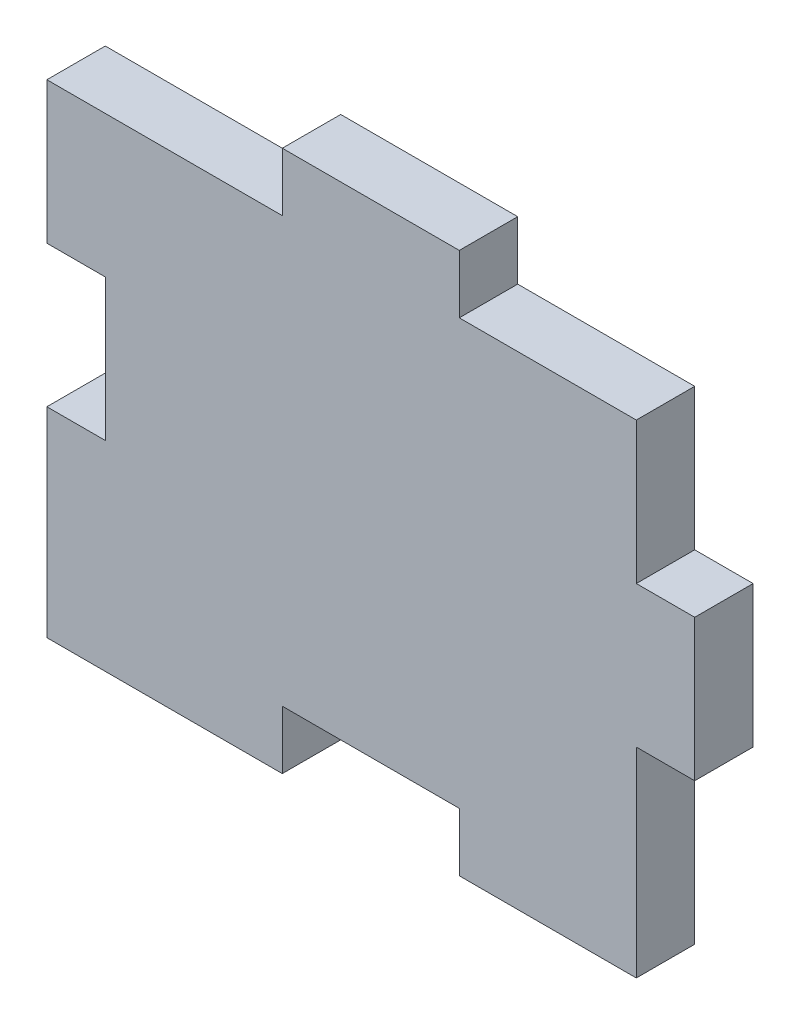
ISO-10303-21;
HEADER;
FILE_DESCRIPTION(('STEP AP214'),'2;1');
FILE_NAME('part.step','',(''),(''),'','','');
FILE_SCHEMA(('AUTOMOTIVE_DESIGN { 1 0 10303 214 1 1 1 1 }'));
ENDSEC;
DATA;
#1=APPLICATION_CONTEXT('core data for automotive mechanical design processes');
#2=APPLICATION_PROTOCOL_DEFINITION('international standard','automotive_design',2000,#1);
#3=PRODUCT_CONTEXT('',#1,'mechanical');
#4=PRODUCT('Part','Part','',(#3));
#5=PRODUCT_RELATED_PRODUCT_CATEGORY('part','',(#4));
#6=PRODUCT_DEFINITION_FORMATION('','',#4);
#7=PRODUCT_DEFINITION_CONTEXT('part definition',#1,'design');
#8=PRODUCT_DEFINITION('design','',#6,#7);
#9=PRODUCT_DEFINITION_SHAPE('','',#8);
#10=(LENGTH_UNIT() NAMED_UNIT(*) SI_UNIT(.MILLI.,.METRE.));
#11=(NAMED_UNIT(*) PLANE_ANGLE_UNIT() SI_UNIT($,.RADIAN.));
#12=(NAMED_UNIT(*) SI_UNIT($,.STERADIAN.) SOLID_ANGLE_UNIT());
#13=UNCERTAINTY_MEASURE_WITH_UNIT(LENGTH_MEASURE(1.E-05),#10,'distance_accuracy_value','');
#14=(GEOMETRIC_REPRESENTATION_CONTEXT(3) GLOBAL_UNCERTAINTY_ASSIGNED_CONTEXT((#13)) GLOBAL_UNIT_ASSIGNED_CONTEXT((#10,
#11,#12)) REPRESENTATION_CONTEXT('',''));
#15=CARTESIAN_POINT('',(0.,0.,0.));
#16=DIRECTION('',(0.,0.,1.));
#17=DIRECTION('',(1.,0.,0.));
#18=AXIS2_PLACEMENT_3D('',#15,#16,#17);
#19=CARTESIAN_POINT('',(33.3333333333333,40.,5.5));
#20=DIRECTION('',(0.,-1.,0.));
#21=DIRECTION('',(1.,0.,0.));
#22=AXIS2_PLACEMENT_3D('',#19,#20,#21);
#23=PLANE('',#22);
#24=DIRECTION('',(-1.,0.,0.));
#25=VECTOR('',#24,1.);
#26=CARTESIAN_POINT('',(33.3333333333333,40.,0.));
#27=LINE('',#26,#25);
#28=CARTESIAN_POINT('',(50.,40.,0.));
#29=VERTEX_POINT('',#28);
#30=CARTESIAN_POINT('',(33.3333333333333,40.,0.));
#31=VERTEX_POINT('',#30);
#32=EDGE_CURVE('E199',#29,#31,#27,.T.);
#33=ORIENTED_EDGE('',*,*,#32,.T.);
#34=DIRECTION('',(0.,0.,-1.));
#35=VECTOR('',#34,1.);
#36=CARTESIAN_POINT('',(33.3333333333333,40.,5.5));
#37=LINE('',#36,#35);
#38=CARTESIAN_POINT('',(33.3333333333333,40.,5.5));
#39=VERTEX_POINT('',#38);
#40=EDGE_CURVE('E11',#39,#31,#37,.T.);
#41=ORIENTED_EDGE('',*,*,#40,.F.);
#42=DIRECTION('',(-1.,0.,0.));
#43=VECTOR('',#42,1.);
#44=CARTESIAN_POINT('',(33.3333333333333,40.,5.5));
#45=LINE('',#44,#43);
#46=CARTESIAN_POINT('',(50.,40.,5.5));
#47=VERTEX_POINT('',#46);
#48=EDGE_CURVE('E240',#47,#39,#45,.T.);
#49=ORIENTED_EDGE('',*,*,#48,.F.);
#50=DIRECTION('',(0.,0.,-1.));
#51=VECTOR('',#50,1.);
#52=CARTESIAN_POINT('',(50.,40.,5.5));
#53=LINE('',#52,#51);
#54=EDGE_CURVE('E195',#47,#29,#53,.T.);
#55=ORIENTED_EDGE('',*,*,#54,.T.);
#56=EDGE_LOOP('',(#33,#41,#49,#55));
#57=FACE_BOUND('',#56,.T.);
#58=ADVANCED_FACE('F31',(#57),#23,.F.);
#59=CARTESIAN_POINT('',(33.3333333333333,40.,5.5));
#60=DIRECTION('',(-1.,0.,0.));
#61=DIRECTION('',(0.,-1.,0.));
#62=AXIS2_PLACEMENT_3D('',#59,#60,#61);
#63=PLANE('',#62);
#64=DIRECTION('',(0.,1.,0.));
#65=VECTOR('',#64,1.);
#66=CARTESIAN_POINT('',(33.3333333333333,40.,0.));
#67=LINE('',#66,#65);
#68=CARTESIAN_POINT('',(33.3333333333333,45.5,0.));
#69=VERTEX_POINT('',#68);
#70=EDGE_CURVE('E202',#31,#69,#67,.T.);
#71=ORIENTED_EDGE('',*,*,#70,.T.);
#72=DIRECTION('',(0.,0.,-1.));
#73=VECTOR('',#72,1.);
#74=CARTESIAN_POINT('',(33.3333333333333,45.5,5.5));
#75=LINE('',#74,#73);
#76=CARTESIAN_POINT('',(33.3333333333333,45.5,5.5));
#77=VERTEX_POINT('',#76);
#78=EDGE_CURVE('E39',#77,#69,#75,.T.);
#79=ORIENTED_EDGE('',*,*,#78,.F.);
#80=DIRECTION('',(0.,1.,0.));
#81=VECTOR('',#80,1.);
#82=CARTESIAN_POINT('',(33.3333333333333,40.,5.5));
#83=LINE('',#82,#81);
#84=EDGE_CURVE('E126',#39,#77,#83,.T.);
#85=ORIENTED_EDGE('',*,*,#84,.F.);
#86=ORIENTED_EDGE('',*,*,#40,.T.);
#87=EDGE_LOOP('',(#71,#79,#85,#86));
#88=FACE_BOUND('',#87,.T.);
#89=ADVANCED_FACE('F356',(#88),#63,.F.);
#90=CARTESIAN_POINT('',(16.6666666666667,45.5,5.5));
#91=DIRECTION('',(0.,-1.,0.));
#92=DIRECTION('',(0.,0.,-1.));
#93=AXIS2_PLACEMENT_3D('',#90,#91,#92);
#94=PLANE('',#93);
#95=DIRECTION('',(-1.,0.,0.));
#96=VECTOR('',#95,1.);
#97=CARTESIAN_POINT('',(16.6666666666667,45.5,0.));
#98=LINE('',#97,#96);
#99=CARTESIAN_POINT('',(16.6666666666667,45.5,0.));
#100=VERTEX_POINT('',#99);
#101=EDGE_CURVE('E204',#69,#100,#98,.T.);
#102=ORIENTED_EDGE('',*,*,#101,.T.);
#103=DIRECTION('',(0.,0.,-1.));
#104=VECTOR('',#103,1.);
#105=CARTESIAN_POINT('',(16.6666666666667,45.5,5.5));
#106=LINE('',#105,#104);
#107=CARTESIAN_POINT('',(16.6666666666667,45.5,5.5));
#108=VERTEX_POINT('',#107);
#109=EDGE_CURVE('E283',#108,#100,#106,.T.);
#110=ORIENTED_EDGE('',*,*,#109,.F.);
#111=DIRECTION('',(-1.,0.,0.));
#112=VECTOR('',#111,1.);
#113=CARTESIAN_POINT('',(16.6666666666667,45.5,5.5));
#114=LINE('',#113,#112);
#115=EDGE_CURVE('E291',#77,#108,#114,.T.);
#116=ORIENTED_EDGE('',*,*,#115,.F.);
#117=ORIENTED_EDGE('',*,*,#78,.T.);
#118=EDGE_LOOP('',(#102,#110,#116,#117));
#119=FACE_BOUND('',#118,.T.);
#120=ADVANCED_FACE('F289',(#119),#94,.F.);
#121=CARTESIAN_POINT('',(16.6666666666667,40.,5.5));
#122=DIRECTION('',(1.,0.,0.));
#123=DIRECTION('',(0.,0.,-1.));
#124=AXIS2_PLACEMENT_3D('',#121,#122,#123);
#125=PLANE('',#124);
#126=DIRECTION('',(0.,-1.,0.));
#127=VECTOR('',#126,1.);
#128=CARTESIAN_POINT('',(16.6666666666667,40.,0.));
#129=LINE('',#128,#127);
#130=CARTESIAN_POINT('',(16.6666666666667,40.,0.));
#131=VERTEX_POINT('',#130);
#132=EDGE_CURVE('E206',#100,#131,#129,.T.);
#133=ORIENTED_EDGE('',*,*,#132,.T.);
#134=DIRECTION('',(0.,0.,-1.));
#135=VECTOR('',#134,1.);
#136=CARTESIAN_POINT('',(16.6666666666667,40.,5.5));
#137=LINE('',#136,#135);
#138=CARTESIAN_POINT('',(16.6666666666667,40.,5.5));
#139=VERTEX_POINT('',#138);
#140=EDGE_CURVE('E280',#139,#131,#137,.T.);
#141=ORIENTED_EDGE('',*,*,#140,.F.);
#142=DIRECTION('',(0.,-1.,0.));
#143=VECTOR('',#142,1.);
#144=CARTESIAN_POINT('',(16.6666666666667,40.,5.5));
#145=LINE('',#144,#143);
#146=EDGE_CURVE('E308',#108,#139,#145,.T.);
#147=ORIENTED_EDGE('',*,*,#146,.F.);
#148=ORIENTED_EDGE('',*,*,#109,.T.);
#149=EDGE_LOOP('',(#133,#141,#147,#148));
#150=FACE_BOUND('',#149,.T.);
#151=ADVANCED_FACE('F299',(#150),#125,.F.);
#152=CARTESIAN_POINT('',(0.,40.,5.5));
#153=DIRECTION('',(0.,-1.,0.));
#154=DIRECTION('',(0.,0.,-1.));
#155=AXIS2_PLACEMENT_3D('',#152,#153,#154);
#156=PLANE('',#155);
#157=DIRECTION('',(-1.,0.,0.));
#158=VECTOR('',#157,1.);
#159=CARTESIAN_POINT('',(0.,40.,0.));
#160=LINE('',#159,#158);
#161=CARTESIAN_POINT('',(-5.5,40.,0.));
#162=VERTEX_POINT('',#161);
#163=EDGE_CURVE('E209',#131,#162,#160,.T.);
#164=ORIENTED_EDGE('',*,*,#163,.T.);
#165=DIRECTION('',(0.,0.,-1.));
#166=VECTOR('',#165,1.);
#167=CARTESIAN_POINT('',(-5.5,40.,5.5));
#168=LINE('',#167,#166);
#169=CARTESIAN_POINT('',(-5.5,40.,5.5));
#170=VERTEX_POINT('',#169);
#171=EDGE_CURVE('E277',#170,#162,#168,.T.);
#172=ORIENTED_EDGE('',*,*,#171,.F.);
#173=DIRECTION('',(-1.,0.,0.));
#174=VECTOR('',#173,1.);
#175=CARTESIAN_POINT('',(0.,40.,5.5));
#176=LINE('',#175,#174);
#177=EDGE_CURVE('E305',#139,#170,#176,.T.);
#178=ORIENTED_EDGE('',*,*,#177,.F.);
#179=ORIENTED_EDGE('',*,*,#140,.T.);
#180=EDGE_LOOP('',(#164,#172,#178,#179));
#181=FACE_BOUND('',#180,.T.);
#182=ADVANCED_FACE('F303',(#181),#156,.F.);
#183=CARTESIAN_POINT('',(-5.5,40.,5.5));
#184=DIRECTION('',(1.,0.,0.));
#185=DIRECTION('',(0.,1.,0.));
#186=AXIS2_PLACEMENT_3D('',#183,#184,#185);
#187=PLANE('',#186);
#188=DIRECTION('',(0.,-1.,0.));
#189=VECTOR('',#188,1.);
#190=CARTESIAN_POINT('',(-5.5,40.,0.));
#191=LINE('',#190,#189);
#192=CARTESIAN_POINT('',(-5.5,26.6666666666667,0.));
#193=VERTEX_POINT('',#192);
#194=EDGE_CURVE('E211',#162,#193,#191,.T.);
#195=ORIENTED_EDGE('',*,*,#194,.T.);
#196=DIRECTION('',(0.,0.,-1.));
#197=VECTOR('',#196,1.);
#198=CARTESIAN_POINT('',(-5.5,26.6666666666667,5.5));
#199=LINE('',#198,#197);
#200=CARTESIAN_POINT('',(-5.5,26.6666666666667,5.5));
#201=VERTEX_POINT('',#200);
#202=EDGE_CURVE('E274',#201,#193,#199,.T.);
#203=ORIENTED_EDGE('',*,*,#202,.F.);
#204=DIRECTION('',(0.,-1.,0.));
#205=VECTOR('',#204,1.);
#206=CARTESIAN_POINT('',(-5.5,40.,5.5));
#207=LINE('',#206,#205);
#208=EDGE_CURVE('E307',#170,#201,#207,.T.);
#209=ORIENTED_EDGE('',*,*,#208,.F.);
#210=ORIENTED_EDGE('',*,*,#171,.T.);
#211=EDGE_LOOP('',(#195,#203,#209,#210));
#212=FACE_BOUND('',#211,.T.);
#213=ADVANCED_FACE('F369',(#212),#187,.F.);
#214=CARTESIAN_POINT('',(0.,26.6666666666667,5.5));
#215=DIRECTION('',(0.,1.,0.));
#216=DIRECTION('',(0.,0.,1.));
#217=AXIS2_PLACEMENT_3D('',#214,#215,#216);
#218=PLANE('',#217);
#219=DIRECTION('',(1.,0.,0.));
#220=VECTOR('',#219,1.);
#221=CARTESIAN_POINT('',(0.,26.6666666666667,0.));
#222=LINE('',#221,#220);
#223=CARTESIAN_POINT('',(0.,26.6666666666667,0.));
#224=VERTEX_POINT('',#223);
#225=EDGE_CURVE('E213',#193,#224,#222,.T.);
#226=ORIENTED_EDGE('',*,*,#225,.T.);
#227=DIRECTION('',(0.,0.,-1.));
#228=VECTOR('',#227,1.);
#229=CARTESIAN_POINT('',(0.,26.6666666666667,5.5));
#230=LINE('',#229,#228);
#231=CARTESIAN_POINT('',(0.,26.6666666666667,5.5));
#232=VERTEX_POINT('',#231);
#233=EDGE_CURVE('E271',#232,#224,#230,.T.);
#234=ORIENTED_EDGE('',*,*,#233,.F.);
#235=DIRECTION('',(1.,0.,0.));
#236=VECTOR('',#235,1.);
#237=CARTESIAN_POINT('',(0.,26.6666666666667,5.5));
#238=LINE('',#237,#236);
#239=EDGE_CURVE('E310',#201,#232,#238,.T.);
#240=ORIENTED_EDGE('',*,*,#239,.F.);
#241=ORIENTED_EDGE('',*,*,#202,.T.);
#242=EDGE_LOOP('',(#226,#234,#240,#241));
#243=FACE_BOUND('',#242,.T.);
#244=ADVANCED_FACE('F372',(#243),#218,.F.);
#245=CARTESIAN_POINT('',(0.,26.6666666666667,5.5));
#246=DIRECTION('',(1.,0.,0.));
#247=DIRECTION('',(0.,1.,0.));
#248=AXIS2_PLACEMENT_3D('',#245,#246,#247);
#249=PLANE('',#248);
#250=DIRECTION('',(0.,-1.,0.));
#251=VECTOR('',#250,1.);
#252=CARTESIAN_POINT('',(0.,26.6666666666667,0.));
#253=LINE('',#252,#251);
#254=CARTESIAN_POINT('',(0.,13.3333333333333,0.));
#255=VERTEX_POINT('',#254);
#256=EDGE_CURVE('E215',#224,#255,#253,.T.);
#257=ORIENTED_EDGE('',*,*,#256,.T.);
#258=DIRECTION('',(0.,0.,-1.));
#259=VECTOR('',#258,1.);
#260=CARTESIAN_POINT('',(0.,13.3333333333333,5.5));
#261=LINE('',#260,#259);
#262=CARTESIAN_POINT('',(0.,13.3333333333333,5.5));
#263=VERTEX_POINT('',#262);
#264=EDGE_CURVE('E268',#263,#255,#261,.T.);
#265=ORIENTED_EDGE('',*,*,#264,.F.);
#266=DIRECTION('',(0.,-1.,0.));
#267=VECTOR('',#266,1.);
#268=CARTESIAN_POINT('',(0.,26.6666666666667,5.5));
#269=LINE('',#268,#267);
#270=EDGE_CURVE('E316',#232,#263,#269,.T.);
#271=ORIENTED_EDGE('',*,*,#270,.F.);
#272=ORIENTED_EDGE('',*,*,#233,.T.);
#273=EDGE_LOOP('',(#257,#265,#271,#272));
#274=FACE_BOUND('',#273,.T.);
#275=ADVANCED_FACE('F376',(#274),#249,.F.);
#276=CARTESIAN_POINT('',(0.,13.3333333333333,5.5));
#277=DIRECTION('',(0.,-1.,0.));
#278=DIRECTION('',(0.,0.,-1.));
#279=AXIS2_PLACEMENT_3D('',#276,#277,#278);
#280=PLANE('',#279);
#281=DIRECTION('',(-1.,0.,0.));
#282=VECTOR('',#281,1.);
#283=CARTESIAN_POINT('',(0.,13.3333333333333,0.));
#284=LINE('',#283,#282);
#285=CARTESIAN_POINT('',(-5.5,13.3333333333333,0.));
#286=VERTEX_POINT('',#285);
#287=EDGE_CURVE('E217',#255,#286,#284,.T.);
#288=ORIENTED_EDGE('',*,*,#287,.T.);
#289=DIRECTION('',(0.,0.,-1.));
#290=VECTOR('',#289,1.);
#291=CARTESIAN_POINT('',(-5.5,13.3333333333333,5.5));
#292=LINE('',#291,#290);
#293=CARTESIAN_POINT('',(-5.5,13.3333333333333,5.5));
#294=VERTEX_POINT('',#293);
#295=EDGE_CURVE('E265',#294,#286,#292,.T.);
#296=ORIENTED_EDGE('',*,*,#295,.F.);
#297=DIRECTION('',(-1.,0.,0.));
#298=VECTOR('',#297,1.);
#299=CARTESIAN_POINT('',(0.,13.3333333333333,5.5));
#300=LINE('',#299,#298);
#301=EDGE_CURVE('E318',#263,#294,#300,.T.);
#302=ORIENTED_EDGE('',*,*,#301,.F.);
#303=ORIENTED_EDGE('',*,*,#264,.T.);
#304=EDGE_LOOP('',(#288,#296,#302,#303));
#305=FACE_BOUND('',#304,.T.);
#306=ADVANCED_FACE('F380',(#305),#280,.F.);
#307=CARTESIAN_POINT('',(-5.5,13.3333333333333,5.5));
#308=DIRECTION('',(1.,0.,0.));
#309=DIRECTION('',(0.,1.,0.));
#310=AXIS2_PLACEMENT_3D('',#307,#308,#309);
#311=PLANE('',#310);
#312=DIRECTION('',(0.,-1.,0.));
#313=VECTOR('',#312,1.);
#314=CARTESIAN_POINT('',(-5.5,13.3333333333333,0.));
#315=LINE('',#314,#313);
#316=CARTESIAN_POINT('',(-5.5,-5.50000000000001,0.));
#317=VERTEX_POINT('',#316);
#318=EDGE_CURVE('E219',#286,#317,#315,.T.);
#319=ORIENTED_EDGE('',*,*,#318,.T.);
#320=DIRECTION('',(0.,0.,-1.));
#321=VECTOR('',#320,1.);
#322=CARTESIAN_POINT('',(-5.5,-5.50000000000001,5.5));
#323=LINE('',#322,#321);
#324=CARTESIAN_POINT('',(-5.5,-5.50000000000001,5.5));
#325=VERTEX_POINT('',#324);
#326=EDGE_CURVE('E262',#325,#317,#323,.T.);
#327=ORIENTED_EDGE('',*,*,#326,.F.);
#328=DIRECTION('',(0.,-1.,0.));
#329=VECTOR('',#328,1.);
#330=CARTESIAN_POINT('',(-5.5,13.3333333333333,5.5));
#331=LINE('',#330,#329);
#332=EDGE_CURVE('E320',#294,#325,#331,.T.);
#333=ORIENTED_EDGE('',*,*,#332,.F.);
#334=ORIENTED_EDGE('',*,*,#295,.T.);
#335=EDGE_LOOP('',(#319,#327,#333,#334));
#336=FACE_BOUND('',#335,.T.);
#337=ADVANCED_FACE('F384',(#336),#311,.F.);
#338=CARTESIAN_POINT('',(0.,-5.50000000000001,5.5));
#339=DIRECTION('',(0.,1.,0.));
#340=DIRECTION('',(0.,0.,1.));
#341=AXIS2_PLACEMENT_3D('',#338,#339,#340);
#342=PLANE('',#341);
#343=DIRECTION('',(1.,0.,0.));
#344=VECTOR('',#343,1.);
#345=CARTESIAN_POINT('',(0.,-5.50000000000001,0.));
#346=LINE('',#345,#344);
#347=CARTESIAN_POINT('',(16.6666666666667,-5.50000000000001,0.));
#348=VERTEX_POINT('',#347);
#349=EDGE_CURVE('E222',#317,#348,#346,.T.);
#350=ORIENTED_EDGE('',*,*,#349,.T.);
#351=DIRECTION('',(0.,0.,-1.));
#352=VECTOR('',#351,1.);
#353=CARTESIAN_POINT('',(16.6666666666667,-5.50000000000001,5.5));
#354=LINE('',#353,#352);
#355=CARTESIAN_POINT('',(16.6666666666667,-5.50000000000001,5.5));
#356=VERTEX_POINT('',#355);
#357=EDGE_CURVE('E259',#356,#348,#354,.T.);
#358=ORIENTED_EDGE('',*,*,#357,.F.);
#359=DIRECTION('',(1.,0.,0.));
#360=VECTOR('',#359,1.);
#361=CARTESIAN_POINT('',(0.,-5.50000000000001,5.5));
#362=LINE('',#361,#360);
#363=EDGE_CURVE('E322',#325,#356,#362,.T.);
#364=ORIENTED_EDGE('',*,*,#363,.F.);
#365=ORIENTED_EDGE('',*,*,#326,.T.);
#366=EDGE_LOOP('',(#350,#358,#364,#365));
#367=FACE_BOUND('',#366,.T.);
#368=ADVANCED_FACE('F388',(#367),#342,.F.);
#369=CARTESIAN_POINT('',(16.6666666666667,0.,5.5));
#370=DIRECTION('',(-1.,0.,0.));
#371=DIRECTION('',(0.,-1.,0.));
#372=AXIS2_PLACEMENT_3D('',#369,#370,#371);
#373=PLANE('',#372);
#374=DIRECTION('',(0.,1.,0.));
#375=VECTOR('',#374,1.);
#376=CARTESIAN_POINT('',(16.6666666666667,0.,0.));
#377=LINE('',#376,#375);
#378=CARTESIAN_POINT('',(16.6666666666667,0.,0.));
#379=VERTEX_POINT('',#378);
#380=EDGE_CURVE('E224',#348,#379,#377,.T.);
#381=ORIENTED_EDGE('',*,*,#380,.T.);
#382=DIRECTION('',(0.,0.,-1.));
#383=VECTOR('',#382,1.);
#384=CARTESIAN_POINT('',(16.6666666666667,0.,5.5));
#385=LINE('',#384,#383);
#386=CARTESIAN_POINT('',(16.6666666666667,0.,5.5));
#387=VERTEX_POINT('',#386);
#388=EDGE_CURVE('E256',#387,#379,#385,.T.);
#389=ORIENTED_EDGE('',*,*,#388,.F.);
#390=DIRECTION('',(0.,1.,0.));
#391=VECTOR('',#390,1.);
#392=CARTESIAN_POINT('',(16.6666666666667,0.,5.5));
#393=LINE('',#392,#391);
#394=EDGE_CURVE('E324',#356,#387,#393,.T.);
#395=ORIENTED_EDGE('',*,*,#394,.F.);
#396=ORIENTED_EDGE('',*,*,#357,.T.);
#397=EDGE_LOOP('',(#381,#389,#395,#396));
#398=FACE_BOUND('',#397,.T.);
#399=ADVANCED_FACE('F392',(#398),#373,.F.);
#400=CARTESIAN_POINT('',(16.6666666666667,0.,5.5));
#401=DIRECTION('',(0.,1.,0.));
#402=DIRECTION('',(0.,0.,1.));
#403=AXIS2_PLACEMENT_3D('',#400,#401,#402);
#404=PLANE('',#403);
#405=DIRECTION('',(1.,0.,0.));
#406=VECTOR('',#405,1.);
#407=CARTESIAN_POINT('',(16.6666666666667,0.,0.));
#408=LINE('',#407,#406);
#409=CARTESIAN_POINT('',(33.3333333333333,0.,0.));
#410=VERTEX_POINT('',#409);
#411=EDGE_CURVE('E226',#379,#410,#408,.T.);
#412=ORIENTED_EDGE('',*,*,#411,.T.);
#413=DIRECTION('',(0.,0.,-1.));
#414=VECTOR('',#413,1.);
#415=CARTESIAN_POINT('',(33.3333333333333,0.,5.5));
#416=LINE('',#415,#414);
#417=CARTESIAN_POINT('',(33.3333333333333,0.,5.5));
#418=VERTEX_POINT('',#417);
#419=EDGE_CURVE('E253',#418,#410,#416,.T.);
#420=ORIENTED_EDGE('',*,*,#419,.F.);
#421=DIRECTION('',(1.,0.,0.));
#422=VECTOR('',#421,1.);
#423=CARTESIAN_POINT('',(16.6666666666667,0.,5.5));
#424=LINE('',#423,#422);
#425=EDGE_CURVE('E326',#387,#418,#424,.T.);
#426=ORIENTED_EDGE('',*,*,#425,.F.);
#427=ORIENTED_EDGE('',*,*,#388,.T.);
#428=EDGE_LOOP('',(#412,#420,#426,#427));
#429=FACE_BOUND('',#428,.T.);
#430=ADVANCED_FACE('F396',(#429),#404,.F.);
#431=CARTESIAN_POINT('',(33.3333333333333,0.,5.5));
#432=DIRECTION('',(1.,0.,0.));
#433=DIRECTION('',(0.,0.,-1.));
#434=AXIS2_PLACEMENT_3D('',#431,#432,#433);
#435=PLANE('',#434);
#436=DIRECTION('',(0.,-1.,0.));
#437=VECTOR('',#436,1.);
#438=CARTESIAN_POINT('',(33.3333333333333,0.,0.));
#439=LINE('',#438,#437);
#440=CARTESIAN_POINT('',(33.3333333333333,-5.5,0.));
#441=VERTEX_POINT('',#440);
#442=EDGE_CURVE('E228',#410,#441,#439,.T.);
#443=ORIENTED_EDGE('',*,*,#442,.T.);
#444=DIRECTION('',(0.,0.,-1.));
#445=VECTOR('',#444,1.);
#446=CARTESIAN_POINT('',(33.3333333333333,-5.5,5.5));
#447=LINE('',#446,#445);
#448=CARTESIAN_POINT('',(33.3333333333333,-5.5,5.5));
#449=VERTEX_POINT('',#448);
#450=EDGE_CURVE('E250',#449,#441,#447,.T.);
#451=ORIENTED_EDGE('',*,*,#450,.F.);
#452=DIRECTION('',(0.,-1.,0.));
#453=VECTOR('',#452,1.);
#454=CARTESIAN_POINT('',(33.3333333333333,0.,5.5));
#455=LINE('',#454,#453);
#456=EDGE_CURVE('E328',#418,#449,#455,.T.);
#457=ORIENTED_EDGE('',*,*,#456,.F.);
#458=ORIENTED_EDGE('',*,*,#419,.T.);
#459=EDGE_LOOP('',(#443,#451,#457,#458));
#460=FACE_BOUND('',#459,.T.);
#461=ADVANCED_FACE('F400',(#460),#435,.F.);
#462=CARTESIAN_POINT('',(50.,-5.5,5.5));
#463=DIRECTION('',(0.,1.,0.));
#464=DIRECTION('',(-1.,0.,0.));
#465=AXIS2_PLACEMENT_3D('',#462,#463,#464);
#466=PLANE('',#465);
#467=DIRECTION('',(1.,0.,0.));
#468=VECTOR('',#467,1.);
#469=CARTESIAN_POINT('',(50.,-5.5,0.));
#470=LINE('',#469,#468);
#471=CARTESIAN_POINT('',(50.,-5.5,0.));
#472=VERTEX_POINT('',#471);
#473=EDGE_CURVE('E230',#441,#472,#470,.T.);
#474=ORIENTED_EDGE('',*,*,#473,.T.);
#475=DIRECTION('',(0.,0.,-1.));
#476=VECTOR('',#475,1.);
#477=CARTESIAN_POINT('',(50.,-5.5,5.5));
#478=LINE('',#477,#476);
#479=CARTESIAN_POINT('',(50.,-5.5,5.5));
#480=VERTEX_POINT('',#479);
#481=EDGE_CURVE('E247',#480,#472,#478,.T.);
#482=ORIENTED_EDGE('',*,*,#481,.F.);
#483=DIRECTION('',(1.,0.,0.));
#484=VECTOR('',#483,1.);
#485=CARTESIAN_POINT('',(50.,-5.5,5.5));
#486=LINE('',#485,#484);
#487=EDGE_CURVE('E330',#449,#480,#486,.T.);
#488=ORIENTED_EDGE('',*,*,#487,.F.);
#489=ORIENTED_EDGE('',*,*,#450,.T.);
#490=EDGE_LOOP('',(#474,#482,#488,#489));
#491=FACE_BOUND('',#490,.T.);
#492=ADVANCED_FACE('F404',(#491),#466,.F.);
#493=CARTESIAN_POINT('',(50.,0.,5.5));
#494=DIRECTION('',(-1.,0.,0.));
#495=DIRECTION('',(0.,-1.,0.));
#496=AXIS2_PLACEMENT_3D('',#493,#494,#495);
#497=PLANE('',#496);
#498=DIRECTION('',(0.,1.,0.));
#499=VECTOR('',#498,1.);
#500=CARTESIAN_POINT('',(50.,0.,0.));
#501=LINE('',#500,#499);
#502=CARTESIAN_POINT('',(50.,13.3333333333333,0.));
#503=VERTEX_POINT('',#502);
#504=EDGE_CURVE('E233',#472,#503,#501,.T.);
#505=ORIENTED_EDGE('',*,*,#504,.T.);
#506=DIRECTION('',(0.,0.,-1.));
#507=VECTOR('',#506,1.);
#508=CARTESIAN_POINT('',(50.,13.3333333333333,5.5));
#509=LINE('',#508,#507);
#510=CARTESIAN_POINT('',(50.,13.3333333333333,5.5));
#511=VERTEX_POINT('',#510);
#512=EDGE_CURVE('E244',#511,#503,#509,.T.);
#513=ORIENTED_EDGE('',*,*,#512,.F.);
#514=DIRECTION('',(0.,1.,0.));
#515=VECTOR('',#514,1.);
#516=CARTESIAN_POINT('',(50.,0.,5.5));
#517=LINE('',#516,#515);
#518=EDGE_CURVE('E332',#480,#511,#517,.T.);
#519=ORIENTED_EDGE('',*,*,#518,.F.);
#520=ORIENTED_EDGE('',*,*,#481,.T.);
#521=EDGE_LOOP('',(#505,#513,#519,#520));
#522=FACE_BOUND('',#521,.T.);
#523=ADVANCED_FACE('F338',(#522),#497,.F.);
#524=CARTESIAN_POINT('',(50.,13.3333333333333,5.5));
#525=DIRECTION('',(0.,1.,0.));
#526=DIRECTION('',(0.,0.,1.));
#527=AXIS2_PLACEMENT_3D('',#524,#525,#526);
#528=PLANE('',#527);
#529=DIRECTION('',(1.,0.,0.));
#530=VECTOR('',#529,1.);
#531=CARTESIAN_POINT('',(50.,13.3333333333333,0.));
#532=LINE('',#531,#530);
#533=CARTESIAN_POINT('',(55.5,13.3333333333333,0.));
#534=VERTEX_POINT('',#533);
#535=EDGE_CURVE('E235',#503,#534,#532,.T.);
#536=ORIENTED_EDGE('',*,*,#535,.T.);
#537=DIRECTION('',(0.,0.,-1.));
#538=VECTOR('',#537,1.);
#539=CARTESIAN_POINT('',(55.5,13.3333333333333,5.5));
#540=LINE('',#539,#538);
#541=CARTESIAN_POINT('',(55.5,13.3333333333333,5.5));
#542=VERTEX_POINT('',#541);
#543=EDGE_CURVE('E190',#542,#534,#540,.T.);
#544=ORIENTED_EDGE('',*,*,#543,.F.);
#545=DIRECTION('',(1.,0.,0.));
#546=VECTOR('',#545,1.);
#547=CARTESIAN_POINT('',(50.,13.3333333333333,5.5));
#548=LINE('',#547,#546);
#549=EDGE_CURVE('E181',#511,#542,#548,.T.);
#550=ORIENTED_EDGE('',*,*,#549,.F.);
#551=ORIENTED_EDGE('',*,*,#512,.T.);
#552=EDGE_LOOP('',(#536,#544,#550,#551));
#553=FACE_BOUND('',#552,.T.);
#554=ADVANCED_FACE('F341',(#553),#528,.F.);
#555=CARTESIAN_POINT('',(55.5,26.6666666666667,5.5));
#556=DIRECTION('',(-1.,0.,0.));
#557=DIRECTION('',(0.,0.,1.));
#558=AXIS2_PLACEMENT_3D('',#555,#556,#557);
#559=PLANE('',#558);
#560=DIRECTION('',(0.,1.,0.));
#561=VECTOR('',#560,1.);
#562=CARTESIAN_POINT('',(55.5,26.6666666666667,0.));
#563=LINE('',#562,#561);
#564=CARTESIAN_POINT('',(55.5,26.6666666666667,0.));
#565=VERTEX_POINT('',#564);
#566=EDGE_CURVE('E189',#534,#565,#563,.T.);
#567=ORIENTED_EDGE('',*,*,#566,.T.);
#568=DIRECTION('',(0.,0.,-1.));
#569=VECTOR('',#568,1.);
#570=CARTESIAN_POINT('',(55.5,26.6666666666667,5.5));
#571=LINE('',#570,#569);
#572=CARTESIAN_POINT('',(55.5,26.6666666666667,5.5));
#573=VERTEX_POINT('',#572);
#574=EDGE_CURVE('E186',#573,#565,#571,.T.);
#575=ORIENTED_EDGE('',*,*,#574,.F.);
#576=DIRECTION('',(0.,1.,0.));
#577=VECTOR('',#576,1.);
#578=CARTESIAN_POINT('',(55.5,26.6666666666667,5.5));
#579=LINE('',#578,#577);
#580=EDGE_CURVE('E175',#542,#573,#579,.T.);
#581=ORIENTED_EDGE('',*,*,#580,.F.);
#582=ORIENTED_EDGE('',*,*,#543,.T.);
#583=EDGE_LOOP('',(#567,#575,#581,#582));
#584=FACE_BOUND('',#583,.T.);
#585=ADVANCED_FACE('F187',(#584),#559,.F.);
#586=CARTESIAN_POINT('',(50.,26.6666666666667,5.5));
#587=DIRECTION('',(0.,-1.,0.));
#588=DIRECTION('',(1.,0.,0.));
#589=AXIS2_PLACEMENT_3D('',#586,#587,#588);
#590=PLANE('',#589);
#591=DIRECTION('',(-1.,0.,0.));
#592=VECTOR('',#591,1.);
#593=CARTESIAN_POINT('',(50.,26.6666666666667,0.));
#594=LINE('',#593,#592);
#595=CARTESIAN_POINT('',(50.,26.6666666666667,0.));
#596=VERTEX_POINT('',#595);
#597=EDGE_CURVE('E112',#565,#596,#594,.T.);
#598=ORIENTED_EDGE('',*,*,#597,.T.);
#599=DIRECTION('',(0.,0.,-1.));
#600=VECTOR('',#599,1.);
#601=CARTESIAN_POINT('',(50.,26.6666666666667,5.5));
#602=LINE('',#601,#600);
#603=CARTESIAN_POINT('',(50.,26.6666666666667,5.5));
#604=VERTEX_POINT('',#603);
#605=EDGE_CURVE('E191',#604,#596,#602,.T.);
#606=ORIENTED_EDGE('',*,*,#605,.F.);
#607=DIRECTION('',(-1.,0.,0.));
#608=VECTOR('',#607,1.);
#609=CARTESIAN_POINT('',(50.,26.6666666666667,5.5));
#610=LINE('',#609,#608);
#611=EDGE_CURVE('E179',#573,#604,#610,.T.);
#612=ORIENTED_EDGE('',*,*,#611,.F.);
#613=ORIENTED_EDGE('',*,*,#574,.T.);
#614=EDGE_LOOP('',(#598,#606,#612,#613));
#615=FACE_BOUND('',#614,.T.);
#616=ADVANCED_FACE('F193',(#615),#590,.F.);
#617=CARTESIAN_POINT('',(50.,26.6666666666667,5.5));
#618=DIRECTION('',(-1.,0.,0.));
#619=DIRECTION('',(0.,0.,1.));
#620=AXIS2_PLACEMENT_3D('',#617,#618,#619);
#621=PLANE('',#620);
#622=DIRECTION('',(0.,1.,0.));
#623=VECTOR('',#622,1.);
#624=CARTESIAN_POINT('',(50.,26.6666666666667,0.));
#625=LINE('',#624,#623);
#626=EDGE_CURVE('E118',#596,#29,#625,.T.);
#627=ORIENTED_EDGE('',*,*,#626,.T.);
#628=ORIENTED_EDGE('',*,*,#54,.F.);
#629=DIRECTION('',(0.,1.,0.));
#630=VECTOR('',#629,1.);
#631=CARTESIAN_POINT('',(50.,26.6666666666667,5.5));
#632=LINE('',#631,#630);
#633=EDGE_CURVE('E47',#604,#47,#632,.T.);
#634=ORIENTED_EDGE('',*,*,#633,.F.);
#635=ORIENTED_EDGE('',*,*,#605,.T.);
#636=EDGE_LOOP('',(#627,#628,#634,#635));
#637=FACE_BOUND('',#636,.T.);
#638=ADVANCED_FACE('F345',(#637),#621,.F.);
#639=CARTESIAN_POINT('',(50.,40.,5.5));
#640=DIRECTION('',(0.,0.,1.));
#641=DIRECTION('',(1.,0.,0.));
#642=AXIS2_PLACEMENT_3D('',#639,#640,#641);
#643=PLANE('',#642);
#644=ORIENTED_EDGE('',*,*,#48,.T.);
#645=ORIENTED_EDGE('',*,*,#84,.T.);
#646=ORIENTED_EDGE('',*,*,#115,.T.);
#647=ORIENTED_EDGE('',*,*,#146,.T.);
#648=ORIENTED_EDGE('',*,*,#177,.T.);
#649=ORIENTED_EDGE('',*,*,#208,.T.);
#650=ORIENTED_EDGE('',*,*,#239,.T.);
#651=ORIENTED_EDGE('',*,*,#270,.T.);
#652=ORIENTED_EDGE('',*,*,#301,.T.);
#653=ORIENTED_EDGE('',*,*,#332,.T.);
#654=ORIENTED_EDGE('',*,*,#363,.T.);
#655=ORIENTED_EDGE('',*,*,#394,.T.);
#656=ORIENTED_EDGE('',*,*,#425,.T.);
#657=ORIENTED_EDGE('',*,*,#456,.T.);
#658=ORIENTED_EDGE('',*,*,#487,.T.);
#659=ORIENTED_EDGE('',*,*,#518,.T.);
#660=ORIENTED_EDGE('',*,*,#549,.T.);
#661=ORIENTED_EDGE('',*,*,#580,.T.);
#662=ORIENTED_EDGE('',*,*,#611,.T.);
#663=ORIENTED_EDGE('',*,*,#633,.T.);
#664=EDGE_LOOP('',(#644,#645,#646,#647,#648,#649,#650,#651,#652,#653,#654,#655,#656,#657,#658,
#659,#660,#661,#662,#663));
#665=FACE_BOUND('',#664,.T.);
#666=ADVANCED_FACE('F177',(#665),#643,.T.);
#667=CARTESIAN_POINT('',(50.,40.,0.));
#668=DIRECTION('',(0.,0.,1.));
#669=DIRECTION('',(1.,0.,0.));
#670=AXIS2_PLACEMENT_3D('',#667,#668,#669);
#671=PLANE('',#670);
#672=ORIENTED_EDGE('',*,*,#32,.F.);
#673=ORIENTED_EDGE('',*,*,#626,.F.);
#674=ORIENTED_EDGE('',*,*,#597,.F.);
#675=ORIENTED_EDGE('',*,*,#566,.F.);
#676=ORIENTED_EDGE('',*,*,#535,.F.);
#677=ORIENTED_EDGE('',*,*,#504,.F.);
#678=ORIENTED_EDGE('',*,*,#473,.F.);
#679=ORIENTED_EDGE('',*,*,#442,.F.);
#680=ORIENTED_EDGE('',*,*,#411,.F.);
#681=ORIENTED_EDGE('',*,*,#380,.F.);
#682=ORIENTED_EDGE('',*,*,#349,.F.);
#683=ORIENTED_EDGE('',*,*,#318,.F.);
#684=ORIENTED_EDGE('',*,*,#287,.F.);
#685=ORIENTED_EDGE('',*,*,#256,.F.);
#686=ORIENTED_EDGE('',*,*,#225,.F.);
#687=ORIENTED_EDGE('',*,*,#194,.F.);
#688=ORIENTED_EDGE('',*,*,#163,.F.);
#689=ORIENTED_EDGE('',*,*,#132,.F.);
#690=ORIENTED_EDGE('',*,*,#101,.F.);
#691=ORIENTED_EDGE('',*,*,#70,.F.);
#692=EDGE_LOOP('',(#672,#673,#674,#675,#676,#677,#678,#679,#680,#681,#682,#683,#684,#685,#686,
#687,#688,#689,#690,#691));
#693=FACE_BOUND('',#692,.T.);
#694=ADVANCED_FACE('F295',(#693),#671,.F.);
#695=CLOSED_SHELL('',(#58,#89,#120,#151,#182,#213,#244,#275,#306,#337,#368,#399,#430,#461,#492,
#523,#554,#585,#616,#638,#666,#694));
#696=MANIFOLD_SOLID_BREP('B2',#695);
#697=ADVANCED_BREP_SHAPE_REPRESENTATION('',(#18,#696),#14);
#698=SHAPE_DEFINITION_REPRESENTATION(#9,#697);
ENDSEC;
END-ISO-10303-21;
